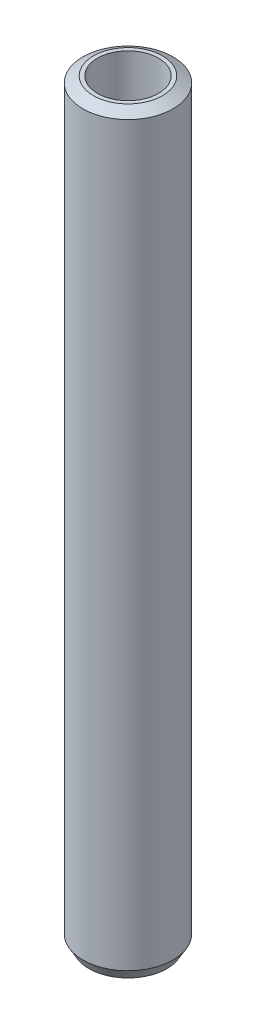
ISO-10303-21;
HEADER;
FILE_DESCRIPTION(('STEP AP214'),'2;1');
FILE_NAME('part.step','',(''),(''),'','','');
FILE_SCHEMA(('AUTOMOTIVE_DESIGN { 1 0 10303 214 1 1 1 1 }'));
ENDSEC;
DATA;
#1=APPLICATION_CONTEXT('core data for automotive mechanical design processes');
#2=APPLICATION_PROTOCOL_DEFINITION('international standard','automotive_design',2000,#1);
#3=PRODUCT_CONTEXT('',#1,'mechanical');
#4=PRODUCT('Part','Part','',(#3));
#5=PRODUCT_RELATED_PRODUCT_CATEGORY('part','',(#4));
#6=PRODUCT_DEFINITION_FORMATION('','',#4);
#7=PRODUCT_DEFINITION_CONTEXT('part definition',#1,'design');
#8=PRODUCT_DEFINITION('design','',#6,#7);
#9=PRODUCT_DEFINITION_SHAPE('','',#8);
#10=(LENGTH_UNIT() NAMED_UNIT(*) SI_UNIT(.MILLI.,.METRE.));
#11=(NAMED_UNIT(*) PLANE_ANGLE_UNIT() SI_UNIT($,.RADIAN.));
#12=(NAMED_UNIT(*) SI_UNIT($,.STERADIAN.) SOLID_ANGLE_UNIT());
#13=UNCERTAINTY_MEASURE_WITH_UNIT(LENGTH_MEASURE(1.E-05),#10,'distance_accuracy_value','');
#14=(GEOMETRIC_REPRESENTATION_CONTEXT(3) GLOBAL_UNCERTAINTY_ASSIGNED_CONTEXT((#13)) GLOBAL_UNIT_ASSIGNED_CONTEXT((#10,
#11,#12)) REPRESENTATION_CONTEXT('',''));
#15=CARTESIAN_POINT('',(0.,0.,0.));
#16=DIRECTION('',(0.,0.,1.));
#17=DIRECTION('',(1.,0.,0.));
#18=AXIS2_PLACEMENT_3D('',#15,#16,#17);
#19=CARTESIAN_POINT('',(0.,334.302653047387,0.));
#20=DIRECTION('',(0.,-1.,0.));
#21=DIRECTION('',(0.,0.,-1.));
#22=AXIS2_PLACEMENT_3D('',#19,#20,#21);
#23=CYLINDRICAL_SURFACE('',#22,20.);
#24=CARTESIAN_POINT('',(0.,331.592944864135,0.));
#25=DIRECTION('',(0.,1.,0.));
#26=DIRECTION('',(0.,0.,1.));
#27=AXIS2_PLACEMENT_3D('',#24,#25,#26);
#28=CIRCLE('',#27,20.);
#29=CARTESIAN_POINT('',(0.,331.592944864135,20.));
#30=VERTEX_POINT('',#29);
#31=EDGE_CURVE('E50',#30,#30,#28,.F.);
#32=ORIENTED_EDGE('',*,*,#31,.T.);
#33=EDGE_LOOP('',(#32));
#34=FACE_BOUND('',#33,.T.);
#35=CARTESIAN_POINT('',(0.,4.69335224707834,0.));
#36=DIRECTION('',(0.,1.,0.));
#37=DIRECTION('',(0.,0.,1.));
#38=AXIS2_PLACEMENT_3D('',#35,#36,#37);
#39=CIRCLE('',#38,20.);
#40=CARTESIAN_POINT('',(0.,4.69335224707834,20.));
#41=VERTEX_POINT('',#40);
#42=EDGE_CURVE('E51',#41,#41,#39,.T.);
#43=ORIENTED_EDGE('',*,*,#42,.T.);
#44=EDGE_LOOP('',(#43));
#45=FACE_BOUND('',#44,.T.);
#46=ADVANCED_FACE('F39',(#34,#45),#23,.T.);
#47=CARTESIAN_POINT('',(0.,334.302653047387,0.));
#48=DIRECTION('',(0.,1.,0.));
#49=DIRECTION('',(0.,0.,1.));
#50=AXIS2_PLACEMENT_3D('',#47,#48,#49);
#51=PLANE('',#50);
#52=CARTESIAN_POINT('',(0.,334.302653047387,0.));
#53=DIRECTION('',(0.,1.,0.));
#54=DIRECTION('',(0.,0.,1.));
#55=AXIS2_PLACEMENT_3D('',#52,#53,#54);
#56=CIRCLE('',#55,15.3066477529216);
#57=CARTESIAN_POINT('',(0.,334.302653047387,15.3066477529216));
#58=VERTEX_POINT('',#57);
#59=EDGE_CURVE('E54',#58,#58,#56,.T.);
#60=ORIENTED_EDGE('',*,*,#59,.T.);
#61=EDGE_LOOP('',(#60));
#62=FACE_BOUND('',#61,.T.);
#63=CARTESIAN_POINT('',(0.,334.302653047387,0.));
#64=DIRECTION('',(0.,1.,0.));
#65=DIRECTION('',(0.,0.,1.));
#66=AXIS2_PLACEMENT_3D('',#63,#64,#65);
#67=CIRCLE('',#66,13.5544096475394);
#68=CARTESIAN_POINT('',(0.,334.302653047387,13.5544096475394));
#69=VERTEX_POINT('',#68);
#70=EDGE_CURVE('E58',#69,#69,#67,.T.);
#71=ORIENTED_EDGE('',*,*,#70,.F.);
#72=EDGE_LOOP('',(#71));
#73=FACE_BOUND('',#72,.T.);
#74=ADVANCED_FACE('F69',(#62,#73),#51,.T.);
#75=CARTESIAN_POINT('',(0.,0.,0.));
#76=DIRECTION('',(0.,1.,0.));
#77=DIRECTION('',(0.,0.,1.));
#78=AXIS2_PLACEMENT_3D('',#75,#76,#77);
#79=PLANE('',#78);
#80=CARTESIAN_POINT('',(0.,0.,0.));
#81=DIRECTION('',(0.,1.,0.));
#82=DIRECTION('',(0.,0.,1.));
#83=AXIS2_PLACEMENT_3D('',#80,#81,#82);
#84=CIRCLE('',#83,17.2902918167476);
#85=CARTESIAN_POINT('',(0.,0.,17.2902918167476));
#86=VERTEX_POINT('',#85);
#87=EDGE_CURVE('E10',#86,#86,#84,.F.);
#88=ORIENTED_EDGE('',*,*,#87,.T.);
#89=EDGE_LOOP('',(#88));
#90=FACE_BOUND('',#89,.T.);
#91=CARTESIAN_POINT('',(0.,0.,0.));
#92=DIRECTION('',(0.,1.,0.));
#93=DIRECTION('',(0.,0.,1.));
#94=AXIS2_PLACEMENT_3D('',#91,#92,#93);
#95=CIRCLE('',#94,13.5544096475394);
#96=CARTESIAN_POINT('',(0.,0.,13.5544096475394));
#97=VERTEX_POINT('',#96);
#98=EDGE_CURVE('E63',#97,#97,#95,.T.);
#99=ORIENTED_EDGE('',*,*,#98,.T.);
#100=EDGE_LOOP('',(#99));
#101=FACE_BOUND('',#100,.T.);
#102=ADVANCED_FACE('F75',(#90,#101),#79,.F.);
#103=CARTESIAN_POINT('',(0.,334.302653047387,0.));
#104=DIRECTION('',(0.,-1.,0.));
#105=DIRECTION('',(0.,0.,-1.));
#106=AXIS2_PLACEMENT_3D('',#103,#104,#105);
#107=CYLINDRICAL_SURFACE('',#106,13.5544096475394);
#108=ORIENTED_EDGE('',*,*,#70,.T.);
#109=EDGE_LOOP('',(#108));
#110=FACE_BOUND('',#109,.T.);
#111=ORIENTED_EDGE('',*,*,#98,.F.);
#112=EDGE_LOOP('',(#111));
#113=FACE_BOUND('',#112,.T.);
#114=ADVANCED_FACE('F70',(#110,#113),#107,.F.);
#115=CARTESIAN_POINT('',(0.,334.302653047387,0.));
#116=DIRECTION('',(0.,-1.,0.));
#117=DIRECTION('',(0.,0.,-1.));
#118=AXIS2_PLACEMENT_3D('',#115,#116,#117);
#119=CONICAL_SURFACE('',#118,15.3066477529216,1.04719755119659);
#120=ORIENTED_EDGE('',*,*,#31,.F.);
#121=EDGE_LOOP('',(#120));
#122=FACE_BOUND('',#121,.T.);
#123=ORIENTED_EDGE('',*,*,#59,.F.);
#124=EDGE_LOOP('',(#123));
#125=FACE_BOUND('',#124,.T.);
#126=ADVANCED_FACE('F81',(#122,#125),#119,.T.);
#127=CARTESIAN_POINT('',(0.,4.69335224707834,0.));
#128=DIRECTION('',(0.,1.,0.));
#129=DIRECTION('',(0.,0.,1.));
#130=AXIS2_PLACEMENT_3D('',#127,#128,#129);
#131=CONICAL_SURFACE('',#130,20.,0.523598775598301);
#132=ORIENTED_EDGE('',*,*,#87,.F.);
#133=EDGE_LOOP('',(#132));
#134=FACE_BOUND('',#133,.T.);
#135=ORIENTED_EDGE('',*,*,#42,.F.);
#136=EDGE_LOOP('',(#135));
#137=FACE_BOUND('',#136,.T.);
#138=ADVANCED_FACE('F45',(#134,#137),#131,.T.);
#139=CLOSED_SHELL('',(#46,#74,#102,#114,#126,#138));
#140=MANIFOLD_SOLID_BREP('B2',#139);
#141=ADVANCED_BREP_SHAPE_REPRESENTATION('',(#18,#140),#14);
#142=SHAPE_DEFINITION_REPRESENTATION(#9,#141);
ENDSEC;
END-ISO-10303-21;
